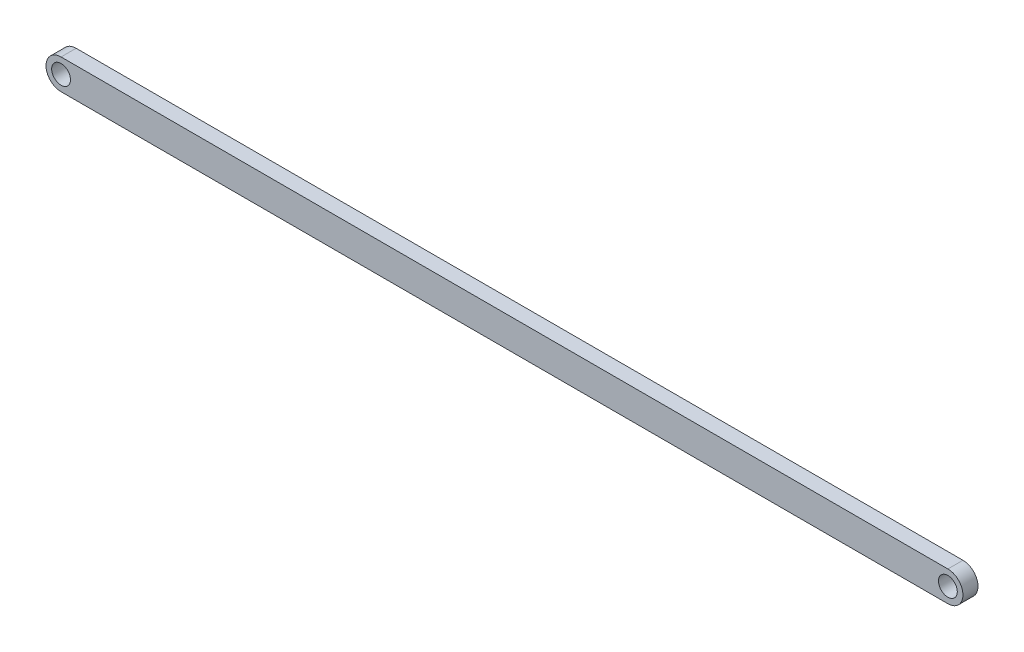
ISO-10303-21;
HEADER;
FILE_DESCRIPTION(('STEP AP214'),'2;1');
FILE_NAME('part.step','',(''),(''),'','','');
FILE_SCHEMA(('AUTOMOTIVE_DESIGN { 1 0 10303 214 1 1 1 1 }'));
ENDSEC;
DATA;
#1=APPLICATION_CONTEXT('core data for automotive mechanical design processes');
#2=APPLICATION_PROTOCOL_DEFINITION('international standard','automotive_design',2000,#1);
#3=PRODUCT_CONTEXT('',#1,'mechanical');
#4=PRODUCT('Part','Part','',(#3));
#5=PRODUCT_RELATED_PRODUCT_CATEGORY('part','',(#4));
#6=PRODUCT_DEFINITION_FORMATION('','',#4);
#7=PRODUCT_DEFINITION_CONTEXT('part definition',#1,'design');
#8=PRODUCT_DEFINITION('design','',#6,#7);
#9=PRODUCT_DEFINITION_SHAPE('','',#8);
#10=(LENGTH_UNIT() NAMED_UNIT(*) SI_UNIT(.MILLI.,.METRE.));
#11=(NAMED_UNIT(*) PLANE_ANGLE_UNIT() SI_UNIT($,.RADIAN.));
#12=(NAMED_UNIT(*) SI_UNIT($,.STERADIAN.) SOLID_ANGLE_UNIT());
#13=UNCERTAINTY_MEASURE_WITH_UNIT(LENGTH_MEASURE(1.E-05),#10,'distance_accuracy_value','');
#14=(GEOMETRIC_REPRESENTATION_CONTEXT(3) GLOBAL_UNCERTAINTY_ASSIGNED_CONTEXT((#13)) GLOBAL_UNIT_ASSIGNED_CONTEXT((#10,
#11,#12)) REPRESENTATION_CONTEXT('',''));
#15=CARTESIAN_POINT('',(0.,0.,0.));
#16=DIRECTION('',(0.,0.,1.));
#17=DIRECTION('',(1.,0.,0.));
#18=AXIS2_PLACEMENT_3D('',#15,#16,#17);
#19=CARTESIAN_POINT('',(0.,0.,3.175));
#20=DIRECTION('',(0.,0.,1.));
#21=DIRECTION('',(1.,0.,0.));
#22=AXIS2_PLACEMENT_3D('',#19,#20,#21);
#23=PLANE('',#22);
#24=CARTESIAN_POINT('',(0.,0.,3.175));
#25=DIRECTION('',(0.,0.,1.));
#26=DIRECTION('',(1.,0.,0.));
#27=AXIS2_PLACEMENT_3D('',#24,#25,#26);
#28=CIRCLE('',#27,1.984375);
#29=CARTESIAN_POINT('',(1.984375,0.,3.175));
#30=VERTEX_POINT('',#29);
#31=EDGE_CURVE('E102',#30,#30,#28,.T.);
#32=ORIENTED_EDGE('',*,*,#31,.F.);
#33=EDGE_LOOP('',(#32));
#34=FACE_BOUND('',#33,.T.);
#35=CARTESIAN_POINT('',(0.,0.,3.175));
#36=DIRECTION('',(0.,0.,1.));
#37=DIRECTION('',(1.,0.,0.));
#38=AXIS2_PLACEMENT_3D('',#35,#36,#37);
#39=CIRCLE('',#38,3.175);
#40=CARTESIAN_POINT('',(0.,3.175,3.175));
#41=VERTEX_POINT('',#40);
#42=CARTESIAN_POINT('',(0.,-3.175,3.175));
#43=VERTEX_POINT('',#42);
#44=EDGE_CURVE('E87',#41,#43,#39,.T.);
#45=ORIENTED_EDGE('',*,*,#44,.T.);
#46=DIRECTION('',(1.,0.,0.));
#47=VECTOR('',#46,1.);
#48=CARTESIAN_POINT('',(0.,-3.175,3.175));
#49=LINE('',#48,#47);
#50=CARTESIAN_POINT('',(186.944,-3.175,3.175));
#51=VERTEX_POINT('',#50);
#52=EDGE_CURVE('E82',#43,#51,#49,.T.);
#53=ORIENTED_EDGE('',*,*,#52,.T.);
#54=CARTESIAN_POINT('',(186.944,0.,3.175));
#55=DIRECTION('',(0.,0.,1.));
#56=DIRECTION('',(1.,0.,0.));
#57=AXIS2_PLACEMENT_3D('',#54,#55,#56);
#58=CIRCLE('',#57,3.175);
#59=CARTESIAN_POINT('',(186.944,3.175,3.175));
#60=VERTEX_POINT('',#59);
#61=EDGE_CURVE('E85',#51,#60,#58,.T.);
#62=ORIENTED_EDGE('',*,*,#61,.T.);
#63=DIRECTION('',(-1.,0.,0.));
#64=VECTOR('',#63,1.);
#65=CARTESIAN_POINT('',(0.,3.175,3.175));
#66=LINE('',#65,#64);
#67=EDGE_CURVE('E52',#60,#41,#66,.T.);
#68=ORIENTED_EDGE('',*,*,#67,.T.);
#69=EDGE_LOOP('',(#45,#53,#62,#68));
#70=FACE_BOUND('',#69,.T.);
#71=CARTESIAN_POINT('',(186.944,0.,3.175));
#72=DIRECTION('',(0.,0.,1.));
#73=DIRECTION('',(1.,0.,0.));
#74=AXIS2_PLACEMENT_3D('',#71,#72,#73);
#75=CIRCLE('',#74,1.98437499999999);
#76=CARTESIAN_POINT('',(188.928375,0.,3.175));
#77=VERTEX_POINT('',#76);
#78=EDGE_CURVE('E117',#77,#77,#75,.T.);
#79=ORIENTED_EDGE('',*,*,#78,.F.);
#80=EDGE_LOOP('',(#79));
#81=FACE_BOUND('',#80,.T.);
#82=ADVANCED_FACE('F35',(#34,#70,#81),#23,.T.);
#83=CARTESIAN_POINT('',(0.,0.,0.));
#84=DIRECTION('',(0.,0.,1.));
#85=DIRECTION('',(1.,0.,0.));
#86=AXIS2_PLACEMENT_3D('',#83,#84,#85);
#87=PLANE('',#86);
#88=CARTESIAN_POINT('',(0.,0.,0.));
#89=DIRECTION('',(0.,0.,1.));
#90=DIRECTION('',(1.,0.,0.));
#91=AXIS2_PLACEMENT_3D('',#88,#89,#90);
#92=CIRCLE('',#91,1.984375);
#93=CARTESIAN_POINT('',(1.984375,0.,0.));
#94=VERTEX_POINT('',#93);
#95=EDGE_CURVE('E114',#94,#94,#92,.T.);
#96=ORIENTED_EDGE('',*,*,#95,.T.);
#97=EDGE_LOOP('',(#96));
#98=FACE_BOUND('',#97,.T.);
#99=CARTESIAN_POINT('',(0.,0.,0.));
#100=DIRECTION('',(0.,0.,1.));
#101=DIRECTION('',(1.,0.,0.));
#102=AXIS2_PLACEMENT_3D('',#99,#100,#101);
#103=CIRCLE('',#102,3.175);
#104=CARTESIAN_POINT('',(0.,3.175,0.));
#105=VERTEX_POINT('',#104);
#106=CARTESIAN_POINT('',(0.,-3.175,0.));
#107=VERTEX_POINT('',#106);
#108=EDGE_CURVE('E99',#105,#107,#103,.T.);
#109=ORIENTED_EDGE('',*,*,#108,.F.);
#110=DIRECTION('',(-1.,0.,0.));
#111=VECTOR('',#110,1.);
#112=CARTESIAN_POINT('',(0.,3.175,0.));
#113=LINE('',#112,#111);
#114=CARTESIAN_POINT('',(186.944,3.175,0.));
#115=VERTEX_POINT('',#114);
#116=EDGE_CURVE('E75',#115,#105,#113,.T.);
#117=ORIENTED_EDGE('',*,*,#116,.F.);
#118=CARTESIAN_POINT('',(186.944,0.,0.));
#119=DIRECTION('',(0.,0.,1.));
#120=DIRECTION('',(1.,0.,0.));
#121=AXIS2_PLACEMENT_3D('',#118,#119,#120);
#122=CIRCLE('',#121,3.175);
#123=CARTESIAN_POINT('',(186.944,-3.175,0.));
#124=VERTEX_POINT('',#123);
#125=EDGE_CURVE('E69',#124,#115,#122,.T.);
#126=ORIENTED_EDGE('',*,*,#125,.F.);
#127=DIRECTION('',(1.,0.,0.));
#128=VECTOR('',#127,1.);
#129=CARTESIAN_POINT('',(0.,-3.175,0.));
#130=LINE('',#129,#128);
#131=EDGE_CURVE('E91',#107,#124,#130,.T.);
#132=ORIENTED_EDGE('',*,*,#131,.F.);
#133=EDGE_LOOP('',(#109,#117,#126,#132));
#134=FACE_BOUND('',#133,.T.);
#135=CARTESIAN_POINT('',(186.944,0.,0.));
#136=DIRECTION('',(0.,0.,1.));
#137=DIRECTION('',(1.,0.,0.));
#138=AXIS2_PLACEMENT_3D('',#135,#136,#137);
#139=CIRCLE('',#138,1.98437499999999);
#140=CARTESIAN_POINT('',(188.928375,0.,0.));
#141=VERTEX_POINT('',#140);
#142=EDGE_CURVE('E120',#141,#141,#139,.T.);
#143=ORIENTED_EDGE('',*,*,#142,.T.);
#144=EDGE_LOOP('',(#143));
#145=FACE_BOUND('',#144,.T.);
#146=ADVANCED_FACE('F110',(#98,#134,#145),#87,.F.);
#147=CARTESIAN_POINT('',(0.,0.,3.175));
#148=DIRECTION('',(0.,0.,-1.));
#149=DIRECTION('',(-1.,0.,0.));
#150=AXIS2_PLACEMENT_3D('',#147,#148,#149);
#151=CYLINDRICAL_SURFACE('',#150,3.175);
#152=ORIENTED_EDGE('',*,*,#108,.T.);
#153=DIRECTION('',(0.,0.,-1.));
#154=VECTOR('',#153,1.);
#155=CARTESIAN_POINT('',(0.,-3.175,3.175));
#156=LINE('',#155,#154);
#157=EDGE_CURVE('E11',#43,#107,#156,.T.);
#158=ORIENTED_EDGE('',*,*,#157,.F.);
#159=ORIENTED_EDGE('',*,*,#44,.F.);
#160=DIRECTION('',(0.,0.,-1.));
#161=VECTOR('',#160,1.);
#162=CARTESIAN_POINT('',(0.,3.175,3.175));
#163=LINE('',#162,#161);
#164=EDGE_CURVE('E95',#41,#105,#163,.T.);
#165=ORIENTED_EDGE('',*,*,#164,.T.);
#166=EDGE_LOOP('',(#152,#158,#159,#165));
#167=FACE_BOUND('',#166,.T.);
#168=ADVANCED_FACE('F37',(#167),#151,.T.);
#169=CARTESIAN_POINT('',(0.,-3.175,3.175));
#170=DIRECTION('',(0.,1.,0.));
#171=DIRECTION('',(0.,0.,1.));
#172=AXIS2_PLACEMENT_3D('',#169,#170,#171);
#173=PLANE('',#172);
#174=ORIENTED_EDGE('',*,*,#131,.T.);
#175=DIRECTION('',(0.,0.,-1.));
#176=VECTOR('',#175,1.);
#177=CARTESIAN_POINT('',(186.944,-3.175,3.175));
#178=LINE('',#177,#176);
#179=EDGE_CURVE('E44',#51,#124,#178,.T.);
#180=ORIENTED_EDGE('',*,*,#179,.F.);
#181=ORIENTED_EDGE('',*,*,#52,.F.);
#182=ORIENTED_EDGE('',*,*,#157,.T.);
#183=EDGE_LOOP('',(#174,#180,#181,#182));
#184=FACE_BOUND('',#183,.T.);
#185=ADVANCED_FACE('F90',(#184),#173,.F.);
#186=CARTESIAN_POINT('',(186.944,0.,3.175));
#187=DIRECTION('',(0.,0.,-1.));
#188=DIRECTION('',(-1.,0.,0.));
#189=AXIS2_PLACEMENT_3D('',#186,#187,#188);
#190=CYLINDRICAL_SURFACE('',#189,3.175);
#191=ORIENTED_EDGE('',*,*,#125,.T.);
#192=DIRECTION('',(0.,0.,-1.));
#193=VECTOR('',#192,1.);
#194=CARTESIAN_POINT('',(186.944,3.175,3.175));
#195=LINE('',#194,#193);
#196=EDGE_CURVE('E92',#60,#115,#195,.T.);
#197=ORIENTED_EDGE('',*,*,#196,.F.);
#198=ORIENTED_EDGE('',*,*,#61,.F.);
#199=ORIENTED_EDGE('',*,*,#179,.T.);
#200=EDGE_LOOP('',(#191,#197,#198,#199));
#201=FACE_BOUND('',#200,.T.);
#202=ADVANCED_FACE('F93',(#201),#190,.T.);
#203=CARTESIAN_POINT('',(0.,3.175,3.175));
#204=DIRECTION('',(0.,-1.,0.));
#205=DIRECTION('',(0.,0.,-1.));
#206=AXIS2_PLACEMENT_3D('',#203,#204,#205);
#207=PLANE('',#206);
#208=ORIENTED_EDGE('',*,*,#116,.T.);
#209=ORIENTED_EDGE('',*,*,#164,.F.);
#210=ORIENTED_EDGE('',*,*,#67,.F.);
#211=ORIENTED_EDGE('',*,*,#196,.T.);
#212=EDGE_LOOP('',(#208,#209,#210,#211));
#213=FACE_BOUND('',#212,.T.);
#214=ADVANCED_FACE('F107',(#213),#207,.F.);
#215=CARTESIAN_POINT('',(0.,0.,3.175));
#216=DIRECTION('',(0.,0.,-1.));
#217=DIRECTION('',(-1.,0.,0.));
#218=AXIS2_PLACEMENT_3D('',#215,#216,#217);
#219=CYLINDRICAL_SURFACE('',#218,1.984375);
#220=ORIENTED_EDGE('',*,*,#31,.T.);
#221=EDGE_LOOP('',(#220));
#222=FACE_BOUND('',#221,.T.);
#223=ORIENTED_EDGE('',*,*,#95,.F.);
#224=EDGE_LOOP('',(#223));
#225=FACE_BOUND('',#224,.T.);
#226=ADVANCED_FACE('F138',(#222,#225),#219,.F.);
#227=CARTESIAN_POINT('',(186.944,0.,3.175));
#228=DIRECTION('',(0.,0.,-1.));
#229=DIRECTION('',(-1.,0.,0.));
#230=AXIS2_PLACEMENT_3D('',#227,#228,#229);
#231=CYLINDRICAL_SURFACE('',#230,1.98437499999999);
#232=ORIENTED_EDGE('',*,*,#78,.T.);
#233=EDGE_LOOP('',(#232));
#234=FACE_BOUND('',#233,.T.);
#235=ORIENTED_EDGE('',*,*,#142,.F.);
#236=EDGE_LOOP('',(#235));
#237=FACE_BOUND('',#236,.T.);
#238=ADVANCED_FACE('F126',(#234,#237),#231,.F.);
#239=CLOSED_SHELL('',(#82,#146,#168,#185,#202,#214,#226,#238));
#240=MANIFOLD_SOLID_BREP('B2',#239);
#241=ADVANCED_BREP_SHAPE_REPRESENTATION('',(#18,#240),#14);
#242=SHAPE_DEFINITION_REPRESENTATION(#9,#241);
ENDSEC;
END-ISO-10303-21;
